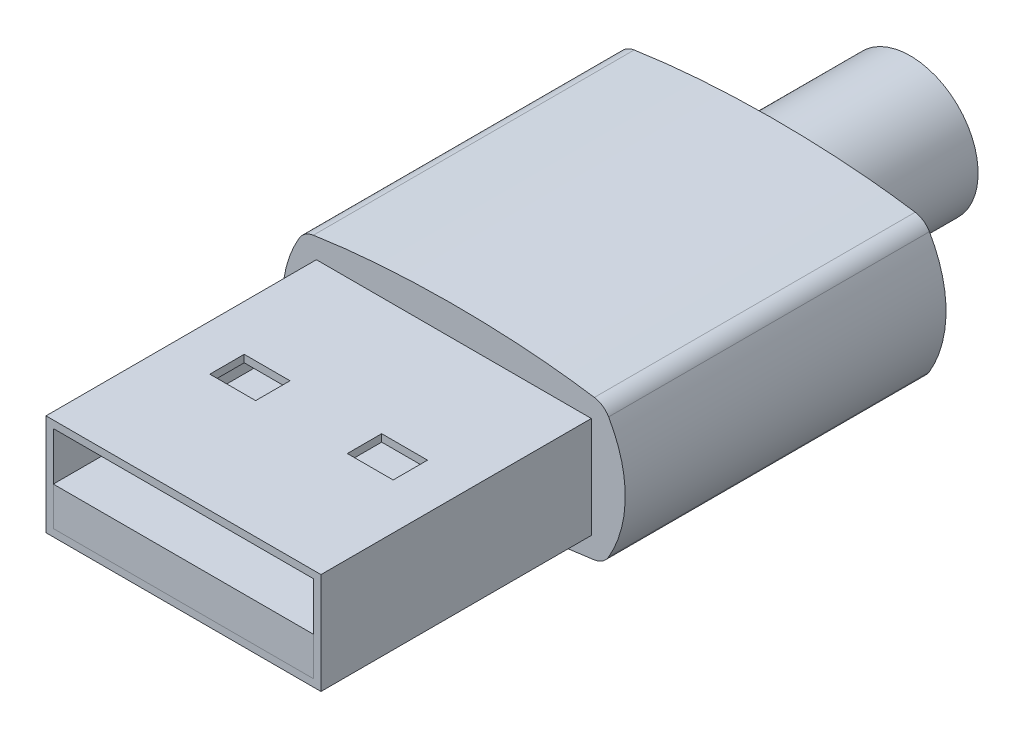
ISO-10303-21;
HEADER;
FILE_DESCRIPTION(('STEP AP214'),'2;1');
FILE_NAME('part.step','',(''),(''),'','','');
FILE_SCHEMA(('AUTOMOTIVE_DESIGN { 1 0 10303 214 1 1 1 1 }'));
ENDSEC;
DATA;
#1=APPLICATION_CONTEXT('core data for automotive mechanical design processes');
#2=APPLICATION_PROTOCOL_DEFINITION('international standard','automotive_design',2000,#1);
#3=PRODUCT_CONTEXT('',#1,'mechanical');
#4=PRODUCT('Part','Part','',(#3));
#5=PRODUCT_RELATED_PRODUCT_CATEGORY('part','',(#4));
#6=PRODUCT_DEFINITION_FORMATION('','',#4);
#7=PRODUCT_DEFINITION_CONTEXT('part definition',#1,'design');
#8=PRODUCT_DEFINITION('design','',#6,#7);
#9=PRODUCT_DEFINITION_SHAPE('','',#8);
#10=(LENGTH_UNIT() NAMED_UNIT(*) SI_UNIT(.MILLI.,.METRE.));
#11=(NAMED_UNIT(*) PLANE_ANGLE_UNIT() SI_UNIT($,.RADIAN.));
#12=(NAMED_UNIT(*) SI_UNIT($,.STERADIAN.) SOLID_ANGLE_UNIT());
#13=UNCERTAINTY_MEASURE_WITH_UNIT(LENGTH_MEASURE(1.E-05),#10,'distance_accuracy_value','');
#14=(GEOMETRIC_REPRESENTATION_CONTEXT(3) GLOBAL_UNCERTAINTY_ASSIGNED_CONTEXT((#13)) GLOBAL_UNIT_ASSIGNED_CONTEXT((#10,
#11,#12)) REPRESENTATION_CONTEXT('',''));
#15=CARTESIAN_POINT('',(0.,0.,0.));
#16=DIRECTION('',(0.,0.,1.));
#17=DIRECTION('',(1.,0.,0.));
#18=AXIS2_PLACEMENT_3D('',#15,#16,#17);
#19=CARTESIAN_POINT('',(0.,0.,0.));
#20=DIRECTION('',(0.,0.,1.));
#21=DIRECTION('',(1.,0.,0.));
#22=AXIS2_PLACEMENT_3D('',#19,#20,#21);
#23=PLANE('',#22);
#24=DIRECTION('',(0.,-1.,0.));
#25=VECTOR('',#24,1.);
#26=CARTESIAN_POINT('',(6.,0.,0.));
#27=LINE('',#26,#25);
#28=CARTESIAN_POINT('',(6.,2.21,0.));
#29=VERTEX_POINT('',#28);
#30=CARTESIAN_POINT('',(6.,-2.21,0.));
#31=VERTEX_POINT('',#30);
#32=EDGE_CURVE('E371',#29,#31,#27,.T.);
#33=ORIENTED_EDGE('',*,*,#32,.F.);
#34=DIRECTION('',(1.,0.,0.));
#35=VECTOR('',#34,1.);
#36=CARTESIAN_POINT('',(0.,2.21,0.));
#37=LINE('',#36,#35);
#38=CARTESIAN_POINT('',(-6.,2.21,0.));
#39=VERTEX_POINT('',#38);
#40=EDGE_CURVE('E421',#39,#29,#37,.T.);
#41=ORIENTED_EDGE('',*,*,#40,.F.);
#42=DIRECTION('',(0.,-1.,0.));
#43=VECTOR('',#42,1.);
#44=CARTESIAN_POINT('',(-6.,0.,0.));
#45=LINE('',#44,#43);
#46=CARTESIAN_POINT('',(-6.,-2.21,0.));
#47=VERTEX_POINT('',#46);
#48=EDGE_CURVE('E417',#39,#47,#45,.T.);
#49=ORIENTED_EDGE('',*,*,#48,.T.);
#50=DIRECTION('',(1.,0.,0.));
#51=VECTOR('',#50,1.);
#52=CARTESIAN_POINT('',(0.,-2.21,0.));
#53=LINE('',#52,#51);
#54=EDGE_CURVE('E413',#47,#31,#53,.T.);
#55=ORIENTED_EDGE('',*,*,#54,.T.);
#56=EDGE_LOOP('',(#33,#41,#49,#55));
#57=FACE_BOUND('',#56,.T.);
#58=DIRECTION('',(-1.,0.,0.));
#59=VECTOR('',#58,1.);
#60=CARTESIAN_POINT('',(0.,-1.89,0.));
#61=LINE('',#60,#59);
#62=CARTESIAN_POINT('',(5.68,-1.89,0.));
#63=VERTEX_POINT('',#62);
#64=CARTESIAN_POINT('',(-5.68,-1.89,0.));
#65=VERTEX_POINT('',#64);
#66=EDGE_CURVE('E374',#63,#65,#61,.T.);
#67=ORIENTED_EDGE('',*,*,#66,.T.);
#68=DIRECTION('',(0.,1.,0.));
#69=VECTOR('',#68,1.);
#70=CARTESIAN_POINT('',(-5.68,0.,0.));
#71=LINE('',#70,#69);
#72=CARTESIAN_POINT('',(-5.68,-0.21,0.));
#73=VERTEX_POINT('',#72);
#74=EDGE_CURVE('E49',#65,#73,#71,.T.);
#75=ORIENTED_EDGE('',*,*,#74,.T.);
#76=DIRECTION('',(0.,-1.,0.));
#77=VECTOR('',#76,1.);
#78=CARTESIAN_POINT('',(-5.68,0.,0.));
#79=LINE('',#78,#77);
#80=CARTESIAN_POINT('',(-5.68,1.89,0.));
#81=VERTEX_POINT('',#80);
#82=EDGE_CURVE('E437',#81,#73,#79,.T.);
#83=ORIENTED_EDGE('',*,*,#82,.F.);
#84=DIRECTION('',(1.,0.,0.));
#85=VECTOR('',#84,1.);
#86=CARTESIAN_POINT('',(0.,1.89,0.));
#87=LINE('',#86,#85);
#88=CARTESIAN_POINT('',(5.68,1.89,0.));
#89=VERTEX_POINT('',#88);
#90=EDGE_CURVE('E433',#81,#89,#87,.T.);
#91=ORIENTED_EDGE('',*,*,#90,.T.);
#92=DIRECTION('',(0.,-1.,0.));
#93=VECTOR('',#92,1.);
#94=CARTESIAN_POINT('',(5.68,0.,0.));
#95=LINE('',#94,#93);
#96=CARTESIAN_POINT('',(5.68,-0.21,0.));
#97=VERTEX_POINT('',#96);
#98=EDGE_CURVE('E430',#89,#97,#95,.T.);
#99=ORIENTED_EDGE('',*,*,#98,.T.);
#100=DIRECTION('',(0.,-1.,0.));
#101=VECTOR('',#100,1.);
#102=CARTESIAN_POINT('',(5.68,0.,0.));
#103=LINE('',#102,#101);
#104=EDGE_CURVE('E378',#97,#63,#103,.T.);
#105=ORIENTED_EDGE('',*,*,#104,.T.);
#106=EDGE_LOOP('',(#67,#75,#83,#91,#99,#105));
#107=FACE_BOUND('',#106,.T.);
#108=ADVANCED_FACE('F45',(#57,#107),#23,.T.);
#109=CARTESIAN_POINT('',(6.,0.,-11.8));
#110=DIRECTION('',(-1.,0.,0.));
#111=DIRECTION('',(0.,-1.,0.));
#112=AXIS2_PLACEMENT_3D('',#109,#110,#111);
#113=PLANE('',#112);
#114=ORIENTED_EDGE('',*,*,#32,.T.);
#115=DIRECTION('',(0.,0.,1.));
#116=VECTOR('',#115,1.);
#117=CARTESIAN_POINT('',(6.,-2.21,-11.8));
#118=LINE('',#117,#116);
#119=CARTESIAN_POINT('',(6.,-2.21,-11.8));
#120=VERTEX_POINT('',#119);
#121=EDGE_CURVE('E383',#120,#31,#118,.T.);
#122=ORIENTED_EDGE('',*,*,#121,.F.);
#123=DIRECTION('',(0.,-1.,0.));
#124=VECTOR('',#123,1.);
#125=CARTESIAN_POINT('',(6.,0.,-11.8));
#126=LINE('',#125,#124);
#127=CARTESIAN_POINT('',(6.,2.21,-11.8));
#128=VERTEX_POINT('',#127);
#129=EDGE_CURVE('E453',#128,#120,#126,.T.);
#130=ORIENTED_EDGE('',*,*,#129,.F.);
#131=DIRECTION('',(0.,0.,1.));
#132=VECTOR('',#131,1.);
#133=CARTESIAN_POINT('',(6.,2.21,-11.8));
#134=LINE('',#133,#132);
#135=EDGE_CURVE('E401',#128,#29,#134,.T.);
#136=ORIENTED_EDGE('',*,*,#135,.T.);
#137=EDGE_LOOP('',(#114,#122,#130,#136));
#138=FACE_BOUND('',#137,.T.);
#139=ADVANCED_FACE('F339',(#138),#113,.F.);
#140=CARTESIAN_POINT('',(0.,-2.21,-11.8));
#141=DIRECTION('',(0.,-1.,0.));
#142=DIRECTION('',(0.,0.,-1.));
#143=AXIS2_PLACEMENT_3D('',#140,#141,#142);
#144=PLANE('',#143);
#145=ORIENTED_EDGE('',*,*,#54,.F.);
#146=DIRECTION('',(0.,0.,1.));
#147=VECTOR('',#146,1.);
#148=CARTESIAN_POINT('',(-6.,-2.21,-11.8));
#149=LINE('',#148,#147);
#150=CARTESIAN_POINT('',(-6.,-2.21,-11.8));
#151=VERTEX_POINT('',#150);
#152=EDGE_CURVE('E408',#151,#47,#149,.T.);
#153=ORIENTED_EDGE('',*,*,#152,.F.);
#154=DIRECTION('',(1.,0.,0.));
#155=VECTOR('',#154,1.);
#156=CARTESIAN_POINT('',(0.,-2.21,-11.8));
#157=LINE('',#156,#155);
#158=EDGE_CURVE('E390',#151,#120,#157,.T.);
#159=ORIENTED_EDGE('',*,*,#158,.T.);
#160=ORIENTED_EDGE('',*,*,#121,.T.);
#161=EDGE_LOOP('',(#145,#153,#159,#160));
#162=FACE_BOUND('',#161,.T.);
#163=ADVANCED_FACE('F335',(#162),#144,.T.);
#164=CARTESIAN_POINT('',(-6.,0.,-11.8));
#165=DIRECTION('',(-1.,0.,0.));
#166=DIRECTION('',(0.,-1.,0.));
#167=AXIS2_PLACEMENT_3D('',#164,#165,#166);
#168=PLANE('',#167);
#169=ORIENTED_EDGE('',*,*,#48,.F.);
#170=DIRECTION('',(0.,0.,1.));
#171=VECTOR('',#170,1.);
#172=CARTESIAN_POINT('',(-6.,2.21,-11.8));
#173=LINE('',#172,#171);
#174=CARTESIAN_POINT('',(-6.,2.21,-11.8));
#175=VERTEX_POINT('',#174);
#176=EDGE_CURVE('E405',#175,#39,#173,.T.);
#177=ORIENTED_EDGE('',*,*,#176,.F.);
#178=DIRECTION('',(0.,-1.,0.));
#179=VECTOR('',#178,1.);
#180=CARTESIAN_POINT('',(-6.,0.,-11.8));
#181=LINE('',#180,#179);
#182=EDGE_CURVE('E445',#175,#151,#181,.T.);
#183=ORIENTED_EDGE('',*,*,#182,.T.);
#184=ORIENTED_EDGE('',*,*,#152,.T.);
#185=EDGE_LOOP('',(#169,#177,#183,#184));
#186=FACE_BOUND('',#185,.T.);
#187=ADVANCED_FACE('F338',(#186),#168,.T.);
#188=CARTESIAN_POINT('',(-5.68,0.,-11.8));
#189=DIRECTION('',(-1.,0.,0.));
#190=DIRECTION('',(0.,-1.,0.));
#191=AXIS2_PLACEMENT_3D('',#188,#189,#190);
#192=PLANE('',#191);
#193=ORIENTED_EDGE('',*,*,#82,.T.);
#194=DIRECTION('',(0.,0.,1.));
#195=VECTOR('',#194,1.);
#196=CARTESIAN_POINT('',(-5.68,-0.21,-11.8));
#197=LINE('',#196,#195);
#198=CARTESIAN_POINT('',(-5.68,-0.21,-11.8));
#199=VERTEX_POINT('',#198);
#200=EDGE_CURVE('E397',#199,#73,#197,.T.);
#201=ORIENTED_EDGE('',*,*,#200,.F.);
#202=DIRECTION('',(0.,-1.,0.));
#203=VECTOR('',#202,1.);
#204=CARTESIAN_POINT('',(-5.68,0.,-11.8));
#205=LINE('',#204,#203);
#206=CARTESIAN_POINT('',(-5.68,1.89,-11.8));
#207=VERTEX_POINT('',#206);
#208=EDGE_CURVE('E416',#207,#199,#205,.T.);
#209=ORIENTED_EDGE('',*,*,#208,.F.);
#210=DIRECTION('',(0.,0.,1.));
#211=VECTOR('',#210,1.);
#212=CARTESIAN_POINT('',(-5.68,1.89,-11.8));
#213=LINE('',#212,#211);
#214=EDGE_CURVE('E386',#207,#81,#213,.T.);
#215=ORIENTED_EDGE('',*,*,#214,.T.);
#216=EDGE_LOOP('',(#193,#201,#209,#215));
#217=FACE_BOUND('',#216,.T.);
#218=ADVANCED_FACE('F47',(#217),#192,.F.);
#219=CARTESIAN_POINT('',(0.,-0.21,-11.8));
#220=DIRECTION('',(0.,-1.,0.));
#221=DIRECTION('',(0.,0.,-1.));
#222=AXIS2_PLACEMENT_3D('',#219,#220,#221);
#223=PLANE('',#222);
#224=DIRECTION('',(1.,0.,0.));
#225=VECTOR('',#224,1.);
#226=CARTESIAN_POINT('',(0.,-0.21,0.));
#227=LINE('',#226,#225);
#228=EDGE_CURVE('E426',#73,#97,#227,.T.);
#229=ORIENTED_EDGE('',*,*,#228,.T.);
#230=DIRECTION('',(0.,0.,1.));
#231=VECTOR('',#230,1.);
#232=CARTESIAN_POINT('',(5.68,-0.21,-11.8));
#233=LINE('',#232,#231);
#234=CARTESIAN_POINT('',(5.68,-0.21,-11.8));
#235=VERTEX_POINT('',#234);
#236=EDGE_CURVE('E393',#235,#97,#233,.T.);
#237=ORIENTED_EDGE('',*,*,#236,.F.);
#238=DIRECTION('',(1.,0.,0.));
#239=VECTOR('',#238,1.);
#240=CARTESIAN_POINT('',(0.,-0.21,-11.8));
#241=LINE('',#240,#239);
#242=EDGE_CURVE('E457',#199,#235,#241,.T.);
#243=ORIENTED_EDGE('',*,*,#242,.F.);
#244=ORIENTED_EDGE('',*,*,#200,.T.);
#245=EDGE_LOOP('',(#229,#237,#243,#244));
#246=FACE_BOUND('',#245,.T.);
#247=ADVANCED_FACE('F350',(#246),#223,.F.);
#248=CARTESIAN_POINT('',(5.68,0.,-11.8));
#249=DIRECTION('',(-1.,0.,0.));
#250=DIRECTION('',(0.,0.,1.));
#251=AXIS2_PLACEMENT_3D('',#248,#249,#250);
#252=PLANE('',#251);
#253=ORIENTED_EDGE('',*,*,#98,.F.);
#254=DIRECTION('',(0.,0.,1.));
#255=VECTOR('',#254,1.);
#256=CARTESIAN_POINT('',(5.68,1.89,-11.8));
#257=LINE('',#256,#255);
#258=CARTESIAN_POINT('',(5.68,1.89,-11.8));
#259=VERTEX_POINT('',#258);
#260=EDGE_CURVE('E389',#259,#89,#257,.T.);
#261=ORIENTED_EDGE('',*,*,#260,.F.);
#262=DIRECTION('',(0.,-1.,0.));
#263=VECTOR('',#262,1.);
#264=CARTESIAN_POINT('',(5.68,0.,-11.8));
#265=LINE('',#264,#263);
#266=EDGE_CURVE('E460',#259,#235,#265,.T.);
#267=ORIENTED_EDGE('',*,*,#266,.T.);
#268=ORIENTED_EDGE('',*,*,#236,.T.);
#269=EDGE_LOOP('',(#253,#261,#267,#268));
#270=FACE_BOUND('',#269,.T.);
#271=ADVANCED_FACE('F353',(#270),#252,.T.);
#272=CARTESIAN_POINT('',(0.,1.89,-11.8));
#273=DIRECTION('',(0.,-1.,0.));
#274=DIRECTION('',(0.,0.,-1.));
#275=AXIS2_PLACEMENT_3D('',#272,#273,#274);
#276=PLANE('',#275);
#277=DIRECTION('',(0.,0.,-1.));
#278=VECTOR('',#277,1.);
#279=CARTESIAN_POINT('',(4.,1.89,-5.15));
#280=LINE('',#279,#278);
#281=CARTESIAN_POINT('',(4.,1.89,-5.15));
#282=VERTEX_POINT('',#281);
#283=CARTESIAN_POINT('',(4.,1.89,-6.65));
#284=VERTEX_POINT('',#283);
#285=EDGE_CURVE('E228',#282,#284,#280,.T.);
#286=ORIENTED_EDGE('',*,*,#285,.T.);
#287=DIRECTION('',(-1.,0.,0.));
#288=VECTOR('',#287,1.);
#289=CARTESIAN_POINT('',(4.,1.89,-6.65));
#290=LINE('',#289,#288);
#291=CARTESIAN_POINT('',(2.,1.89,-6.65));
#292=VERTEX_POINT('',#291);
#293=EDGE_CURVE('E214',#284,#292,#290,.T.);
#294=ORIENTED_EDGE('',*,*,#293,.T.);
#295=DIRECTION('',(0.,0.,1.));
#296=VECTOR('',#295,1.);
#297=CARTESIAN_POINT('',(2.,1.89,-5.15));
#298=LINE('',#297,#296);
#299=CARTESIAN_POINT('',(2.,1.89,-5.15));
#300=VERTEX_POINT('',#299);
#301=EDGE_CURVE('E255',#292,#300,#298,.T.);
#302=ORIENTED_EDGE('',*,*,#301,.T.);
#303=DIRECTION('',(1.,0.,0.));
#304=VECTOR('',#303,1.);
#305=CARTESIAN_POINT('',(4.,1.89,-5.15));
#306=LINE('',#305,#304);
#307=EDGE_CURVE('E237',#300,#282,#306,.T.);
#308=ORIENTED_EDGE('',*,*,#307,.T.);
#309=EDGE_LOOP('',(#286,#294,#302,#308));
#310=FACE_BOUND('',#309,.T.);
#311=DIRECTION('',(-1.,0.,0.));
#312=VECTOR('',#311,1.);
#313=CARTESIAN_POINT('',(-4.,1.89,-6.65));
#314=LINE('',#313,#312);
#315=CARTESIAN_POINT('',(-2.,1.89,-6.65));
#316=VERTEX_POINT('',#315);
#317=CARTESIAN_POINT('',(-4.,1.89,-6.65));
#318=VERTEX_POINT('',#317);
#319=EDGE_CURVE('E266',#316,#318,#314,.T.);
#320=ORIENTED_EDGE('',*,*,#319,.T.);
#321=DIRECTION('',(0.,0.,1.));
#322=VECTOR('',#321,1.);
#323=CARTESIAN_POINT('',(-4.,1.89,-5.15));
#324=LINE('',#323,#322);
#325=CARTESIAN_POINT('',(-4.,1.89,-5.15));
#326=VERTEX_POINT('',#325);
#327=EDGE_CURVE('E295',#318,#326,#324,.T.);
#328=ORIENTED_EDGE('',*,*,#327,.T.);
#329=DIRECTION('',(1.,0.,0.));
#330=VECTOR('',#329,1.);
#331=CARTESIAN_POINT('',(-4.,1.89,-5.15));
#332=LINE('',#331,#330);
#333=CARTESIAN_POINT('',(-2.,1.89,-5.15));
#334=VERTEX_POINT('',#333);
#335=EDGE_CURVE('E290',#326,#334,#332,.T.);
#336=ORIENTED_EDGE('',*,*,#335,.T.);
#337=DIRECTION('',(0.,0.,-1.));
#338=VECTOR('',#337,1.);
#339=CARTESIAN_POINT('',(-2.,1.89,-5.15));
#340=LINE('',#339,#338);
#341=EDGE_CURVE('E285',#334,#316,#340,.T.);
#342=ORIENTED_EDGE('',*,*,#341,.T.);
#343=EDGE_LOOP('',(#320,#328,#336,#342));
#344=FACE_BOUND('',#343,.T.);
#345=ORIENTED_EDGE('',*,*,#90,.F.);
#346=ORIENTED_EDGE('',*,*,#214,.F.);
#347=DIRECTION('',(1.,0.,0.));
#348=VECTOR('',#347,1.);
#349=CARTESIAN_POINT('',(0.,1.89,-11.8));
#350=LINE('',#349,#348);
#351=EDGE_CURVE('E464',#207,#259,#350,.T.);
#352=ORIENTED_EDGE('',*,*,#351,.T.);
#353=ORIENTED_EDGE('',*,*,#260,.T.);
#354=EDGE_LOOP('',(#345,#346,#352,#353));
#355=FACE_BOUND('',#354,.T.);
#356=ADVANCED_FACE('F235',(#310,#344,#355),#276,.T.);
#357=CARTESIAN_POINT('',(0.,2.21,-11.8));
#358=DIRECTION('',(0.,-1.,0.));
#359=DIRECTION('',(0.,0.,-1.));
#360=AXIS2_PLACEMENT_3D('',#357,#358,#359);
#361=PLANE('',#360);
#362=DIRECTION('',(-1.,0.,0.));
#363=VECTOR('',#362,1.);
#364=CARTESIAN_POINT('',(4.,2.21,-6.65));
#365=LINE('',#364,#363);
#366=CARTESIAN_POINT('',(4.,2.21,-6.65));
#367=VERTEX_POINT('',#366);
#368=CARTESIAN_POINT('',(2.,2.21,-6.65));
#369=VERTEX_POINT('',#368);
#370=EDGE_CURVE('E242',#367,#369,#365,.T.);
#371=ORIENTED_EDGE('',*,*,#370,.F.);
#372=DIRECTION('',(0.,0.,-1.));
#373=VECTOR('',#372,1.);
#374=CARTESIAN_POINT('',(4.,2.21,-5.15));
#375=LINE('',#374,#373);
#376=CARTESIAN_POINT('',(4.,2.21,-5.15));
#377=VERTEX_POINT('',#376);
#378=EDGE_CURVE('E231',#377,#367,#375,.T.);
#379=ORIENTED_EDGE('',*,*,#378,.F.);
#380=DIRECTION('',(1.,0.,0.));
#381=VECTOR('',#380,1.);
#382=CARTESIAN_POINT('',(4.,2.21,-5.15));
#383=LINE('',#382,#381);
#384=CARTESIAN_POINT('',(2.,2.21,-5.15));
#385=VERTEX_POINT('',#384);
#386=EDGE_CURVE('E249',#385,#377,#383,.T.);
#387=ORIENTED_EDGE('',*,*,#386,.F.);
#388=DIRECTION('',(0.,0.,1.));
#389=VECTOR('',#388,1.);
#390=CARTESIAN_POINT('',(2.,2.21,-5.15));
#391=LINE('',#390,#389);
#392=EDGE_CURVE('E239',#369,#385,#391,.T.);
#393=ORIENTED_EDGE('',*,*,#392,.F.);
#394=EDGE_LOOP('',(#371,#379,#387,#393));
#395=FACE_BOUND('',#394,.T.);
#396=DIRECTION('',(0.,0.,1.));
#397=VECTOR('',#396,1.);
#398=CARTESIAN_POINT('',(-4.,2.21,-5.15));
#399=LINE('',#398,#397);
#400=CARTESIAN_POINT('',(-4.,2.21,-6.65));
#401=VERTEX_POINT('',#400);
#402=CARTESIAN_POINT('',(-4.,2.21,-5.15));
#403=VERTEX_POINT('',#402);
#404=EDGE_CURVE('E274',#401,#403,#399,.T.);
#405=ORIENTED_EDGE('',*,*,#404,.F.);
#406=DIRECTION('',(-1.,0.,0.));
#407=VECTOR('',#406,1.);
#408=CARTESIAN_POINT('',(-4.,2.21,-6.65));
#409=LINE('',#408,#407);
#410=CARTESIAN_POINT('',(-2.,2.21,-6.65));
#411=VERTEX_POINT('',#410);
#412=EDGE_CURVE('E278',#411,#401,#409,.T.);
#413=ORIENTED_EDGE('',*,*,#412,.F.);
#414=DIRECTION('',(0.,0.,-1.));
#415=VECTOR('',#414,1.);
#416=CARTESIAN_POINT('',(-2.,2.21,-5.15));
#417=LINE('',#416,#415);
#418=CARTESIAN_POINT('',(-2.,2.21,-5.15));
#419=VERTEX_POINT('',#418);
#420=EDGE_CURVE('E282',#419,#411,#417,.T.);
#421=ORIENTED_EDGE('',*,*,#420,.F.);
#422=DIRECTION('',(1.,0.,0.));
#423=VECTOR('',#422,1.);
#424=CARTESIAN_POINT('',(-4.,2.21,-5.15));
#425=LINE('',#424,#423);
#426=EDGE_CURVE('E271',#403,#419,#425,.T.);
#427=ORIENTED_EDGE('',*,*,#426,.F.);
#428=EDGE_LOOP('',(#405,#413,#421,#427));
#429=FACE_BOUND('',#428,.T.);
#430=ORIENTED_EDGE('',*,*,#40,.T.);
#431=ORIENTED_EDGE('',*,*,#135,.F.);
#432=DIRECTION('',(1.,0.,0.));
#433=VECTOR('',#432,1.);
#434=CARTESIAN_POINT('',(0.,2.21,-11.8));
#435=LINE('',#434,#433);
#436=EDGE_CURVE('E449',#175,#128,#435,.T.);
#437=ORIENTED_EDGE('',*,*,#436,.F.);
#438=ORIENTED_EDGE('',*,*,#176,.T.);
#439=EDGE_LOOP('',(#430,#431,#437,#438));
#440=FACE_BOUND('',#439,.T.);
#441=ADVANCED_FACE('F333',(#395,#429,#440),#361,.F.);
#442=ORIENTED_EDGE('',*,*,#74,.F.);
#443=ORIENTED_EDGE('',*,*,#66,.F.);
#444=ORIENTED_EDGE('',*,*,#104,.F.);
#445=ORIENTED_EDGE('',*,*,#228,.F.);
#446=EDGE_LOOP('',(#442,#443,#444,#445));
#447=FACE_BOUND('',#446,.T.);
#448=ADVANCED_FACE('F329',(#447),#23,.T.);
#449=CARTESIAN_POINT('',(0.,0.,-25.8));
#450=DIRECTION('',(0.,0.,-1.));
#451=DIRECTION('',(-1.,0.,0.));
#452=AXIS2_PLACEMENT_3D('',#449,#450,#451);
#453=PLANE('',#452);
#454=CARTESIAN_POINT('',(0.,0.,-25.8));
#455=DIRECTION('',(0.,0.,-1.));
#456=DIRECTION('',(-1.,0.,0.));
#457=AXIS2_PLACEMENT_3D('',#454,#455,#456);
#458=CIRCLE('',#457,2.96);
#459=CARTESIAN_POINT('',(-2.96,0.,-25.8));
#460=VERTEX_POINT('',#459);
#461=EDGE_CURVE('E11',#460,#460,#458,.T.);
#462=ORIENTED_EDGE('',*,*,#461,.F.);
#463=EDGE_LOOP('',(#462));
#464=FACE_BOUND('',#463,.T.);
#465=CARTESIAN_POINT('',(0.,0.,-25.8));
#466=DIRECTION('',(0.,0.,-1.));
#467=DIRECTION('',(1.,0.,0.));
#468=AXIS2_PLACEMENT_3D('',#465,#466,#467);
#469=ELLIPSE('',#468,12.665918953446,3.51);
#470=CARTESIAN_POINT('',(6.13205357131284,-3.0712205721688,-25.8));
#471=VERTEX_POINT('',#470);
#472=CARTESIAN_POINT('',(-6.13205357131284,-3.0712205721688,-25.8));
#473=VERTEX_POINT('',#472);
#474=EDGE_CURVE('E312',#471,#473,#469,.T.);
#475=ORIENTED_EDGE('',*,*,#474,.T.);
#476=CARTESIAN_POINT('',(-6.,-2.21,-25.8));
#477=DIRECTION('',(0.,0.,-1.));
#478=DIRECTION('',(-1.,0.,0.));
#479=AXIS2_PLACEMENT_3D('',#476,#477,#478);
#480=CIRCLE('',#479,0.871285842662002);
#481=CARTESIAN_POINT('',(-6.75436074099455,-2.64598038037209,-25.8));
#482=VERTEX_POINT('',#481);
#483=EDGE_CURVE('E317',#473,#482,#480,.T.);
#484=ORIENTED_EDGE('',*,*,#483,.T.);
#485=CARTESIAN_POINT('',(0.,0.,-25.8));
#486=DIRECTION('',(0.,0.,-1.));
#487=DIRECTION('',(1.,0.,0.));
#488=AXIS2_PLACEMENT_3D('',#485,#486,#487);
#489=ELLIPSE('',#488,7.48,6.15827172943257);
#490=CARTESIAN_POINT('',(-6.75436074099455,2.64598038037209,-25.8));
#491=VERTEX_POINT('',#490);
#492=EDGE_CURVE('E556',#482,#491,#489,.T.);
#493=ORIENTED_EDGE('',*,*,#492,.T.);
#494=CARTESIAN_POINT('',(-6.,2.21,-25.8));
#495=DIRECTION('',(0.,0.,-1.));
#496=DIRECTION('',(-1.,0.,0.));
#497=AXIS2_PLACEMENT_3D('',#494,#495,#496);
#498=CIRCLE('',#497,0.871285842662001);
#499=CARTESIAN_POINT('',(-6.13205357131284,3.0712205721688,-25.8));
#500=VERTEX_POINT('',#499);
#501=EDGE_CURVE('E554',#491,#500,#498,.T.);
#502=ORIENTED_EDGE('',*,*,#501,.T.);
#503=CARTESIAN_POINT('',(0.,0.,-25.8));
#504=DIRECTION('',(0.,0.,-1.));
#505=DIRECTION('',(1.,0.,0.));
#506=AXIS2_PLACEMENT_3D('',#503,#504,#505);
#507=ELLIPSE('',#506,12.665918953446,3.51);
#508=CARTESIAN_POINT('',(6.13205357131284,3.0712205721688,-25.8));
#509=VERTEX_POINT('',#508);
#510=EDGE_CURVE('E550',#500,#509,#507,.T.);
#511=ORIENTED_EDGE('',*,*,#510,.T.);
#512=CARTESIAN_POINT('',(6.,2.21,-25.8));
#513=DIRECTION('',(0.,0.,-1.));
#514=DIRECTION('',(-1.,0.,0.));
#515=AXIS2_PLACEMENT_3D('',#512,#513,#514);
#516=CIRCLE('',#515,0.871285842662001);
#517=CARTESIAN_POINT('',(6.75436074099455,2.64598038037209,-25.8));
#518=VERTEX_POINT('',#517);
#519=EDGE_CURVE('E531',#509,#518,#516,.T.);
#520=ORIENTED_EDGE('',*,*,#519,.T.);
#521=CARTESIAN_POINT('',(0.,0.,-25.8));
#522=DIRECTION('',(0.,0.,-1.));
#523=DIRECTION('',(1.,0.,0.));
#524=AXIS2_PLACEMENT_3D('',#521,#522,#523);
#525=ELLIPSE('',#524,7.48,6.15827172943257);
#526=CARTESIAN_POINT('',(6.75436074099455,-2.64598038037209,-25.8));
#527=VERTEX_POINT('',#526);
#528=EDGE_CURVE('E527',#518,#527,#525,.T.);
#529=ORIENTED_EDGE('',*,*,#528,.T.);
#530=CARTESIAN_POINT('',(6.,-2.21,-25.8));
#531=DIRECTION('',(0.,0.,-1.));
#532=DIRECTION('',(-1.,0.,0.));
#533=AXIS2_PLACEMENT_3D('',#530,#531,#532);
#534=CIRCLE('',#533,0.871285842662001);
#535=EDGE_CURVE('E501',#527,#471,#534,.T.);
#536=ORIENTED_EDGE('',*,*,#535,.T.);
#537=EDGE_LOOP('',(#475,#484,#493,#502,#511,#520,#529,#536));
#538=FACE_BOUND('',#537,.T.);
#539=ADVANCED_FACE('F332',(#464,#538),#453,.T.);
#540=CARTESIAN_POINT('',(6.,-2.21,-25.8));
#541=DIRECTION('',(0.,0.,1.));
#542=DIRECTION('',(1.,0.,0.));
#543=AXIS2_PLACEMENT_3D('',#540,#541,#542);
#544=CYLINDRICAL_SURFACE('',#543,0.871285842662001);
#545=CARTESIAN_POINT('',(6.,-2.21,-11.8));
#546=DIRECTION('',(0.,0.,-1.));
#547=DIRECTION('',(-1.,0.,0.));
#548=AXIS2_PLACEMENT_3D('',#545,#546,#547);
#549=CIRCLE('',#548,0.871285842662001);
#550=CARTESIAN_POINT('',(6.75436074099455,-2.64598038037209,-11.8));
#551=VERTEX_POINT('',#550);
#552=CARTESIAN_POINT('',(6.13205357131284,-3.0712205721688,-11.8));
#553=VERTEX_POINT('',#552);
#554=EDGE_CURVE('E318',#551,#553,#549,.T.);
#555=ORIENTED_EDGE('',*,*,#554,.T.);
#556=DIRECTION('',(0.,0.,1.));
#557=VECTOR('',#556,1.);
#558=CARTESIAN_POINT('',(6.13205357131284,-3.0712205721688,-25.8));
#559=LINE('',#558,#557);
#560=EDGE_CURVE('E497',#471,#553,#559,.T.);
#561=ORIENTED_EDGE('',*,*,#560,.F.);
#562=ORIENTED_EDGE('',*,*,#535,.F.);
#563=DIRECTION('',(0.,0.,1.));
#564=VECTOR('',#563,1.);
#565=CARTESIAN_POINT('',(6.75436074099455,-2.64598038037209,-25.8));
#566=LINE('',#565,#564);
#567=EDGE_CURVE('E493',#527,#551,#566,.T.);
#568=ORIENTED_EDGE('',*,*,#567,.T.);
#569=EDGE_LOOP('',(#555,#561,#562,#568));
#570=FACE_BOUND('',#569,.T.);
#571=ADVANCED_FACE('F539',(#570),#544,.T.);
#572=DIRECTION('',(0.,0.,1.));
#573=VECTOR('',#572,1.);
#574=SURFACE_OF_LINEAR_EXTRUSION('',#525,#573);
#575=CARTESIAN_POINT('',(0.,0.,-11.8));
#576=DIRECTION('',(0.,0.,-1.));
#577=DIRECTION('',(1.,0.,0.));
#578=AXIS2_PLACEMENT_3D('',#575,#576,#577);
#579=ELLIPSE('',#578,7.48,6.15827172943257);
#580=CARTESIAN_POINT('',(6.75436074099455,2.64598038037209,-11.8));
#581=VERTEX_POINT('',#580);
#582=EDGE_CURVE('E504',#581,#551,#579,.T.);
#583=ORIENTED_EDGE('',*,*,#582,.T.);
#584=ORIENTED_EDGE('',*,*,#567,.F.);
#585=ORIENTED_EDGE('',*,*,#528,.F.);
#586=DIRECTION('',(0.,0.,1.));
#587=VECTOR('',#586,1.);
#588=CARTESIAN_POINT('',(6.75436074099455,2.64598038037209,-25.8));
#589=LINE('',#588,#587);
#590=EDGE_CURVE('E489',#518,#581,#589,.T.);
#591=ORIENTED_EDGE('',*,*,#590,.T.);
#592=EDGE_LOOP('',(#583,#584,#585,#591));
#593=FACE_BOUND('',#592,.T.);
#594=ADVANCED_FACE('F534',(#593),#574,.F.);
#595=CARTESIAN_POINT('',(6.,2.21,-25.8));
#596=DIRECTION('',(0.,0.,1.));
#597=DIRECTION('',(1.,0.,0.));
#598=AXIS2_PLACEMENT_3D('',#595,#596,#597);
#599=CYLINDRICAL_SURFACE('',#598,0.871285842662001);
#600=CARTESIAN_POINT('',(6.,2.21,-11.8));
#601=DIRECTION('',(0.,0.,-1.));
#602=DIRECTION('',(-1.,0.,0.));
#603=AXIS2_PLACEMENT_3D('',#600,#601,#602);
#604=CIRCLE('',#603,0.871285842662001);
#605=CARTESIAN_POINT('',(6.13205357131284,3.0712205721688,-11.8));
#606=VERTEX_POINT('',#605);
#607=EDGE_CURVE('E507',#606,#581,#604,.T.);
#608=ORIENTED_EDGE('',*,*,#607,.T.);
#609=ORIENTED_EDGE('',*,*,#590,.F.);
#610=ORIENTED_EDGE('',*,*,#519,.F.);
#611=DIRECTION('',(0.,0.,1.));
#612=VECTOR('',#611,1.);
#613=CARTESIAN_POINT('',(6.13205357131284,3.0712205721688,-25.8));
#614=LINE('',#613,#612);
#615=EDGE_CURVE('E485',#509,#606,#614,.T.);
#616=ORIENTED_EDGE('',*,*,#615,.T.);
#617=EDGE_LOOP('',(#608,#609,#610,#616));
#618=FACE_BOUND('',#617,.T.);
#619=ADVANCED_FACE('F538',(#618),#599,.T.);
#620=DIRECTION('',(0.,0.,1.));
#621=VECTOR('',#620,1.);
#622=SURFACE_OF_LINEAR_EXTRUSION('',#507,#621);
#623=CARTESIAN_POINT('',(0.,0.,-11.8));
#624=DIRECTION('',(0.,0.,-1.));
#625=DIRECTION('',(1.,0.,0.));
#626=AXIS2_PLACEMENT_3D('',#623,#624,#625);
#627=ELLIPSE('',#626,12.665918953446,3.51);
#628=CARTESIAN_POINT('',(-6.13205357131284,3.0712205721688,-11.8));
#629=VERTEX_POINT('',#628);
#630=EDGE_CURVE('E510',#629,#606,#627,.T.);
#631=ORIENTED_EDGE('',*,*,#630,.T.);
#632=ORIENTED_EDGE('',*,*,#615,.F.);
#633=ORIENTED_EDGE('',*,*,#510,.F.);
#634=DIRECTION('',(0.,0.,1.));
#635=VECTOR('',#634,1.);
#636=CARTESIAN_POINT('',(-6.13205357131284,3.0712205721688,-25.8));
#637=LINE('',#636,#635);
#638=EDGE_CURVE('E481',#500,#629,#637,.T.);
#639=ORIENTED_EDGE('',*,*,#638,.T.);
#640=EDGE_LOOP('',(#631,#632,#633,#639));
#641=FACE_BOUND('',#640,.T.);
#642=ADVANCED_FACE('F544',(#641),#622,.F.);
#643=CARTESIAN_POINT('',(-6.,2.21,-25.8));
#644=DIRECTION('',(0.,0.,1.));
#645=DIRECTION('',(1.,0.,0.));
#646=AXIS2_PLACEMENT_3D('',#643,#644,#645);
#647=CYLINDRICAL_SURFACE('',#646,0.871285842662001);
#648=CARTESIAN_POINT('',(-6.,2.21,-11.8));
#649=DIRECTION('',(0.,0.,-1.));
#650=DIRECTION('',(-1.,0.,0.));
#651=AXIS2_PLACEMENT_3D('',#648,#649,#650);
#652=CIRCLE('',#651,0.871285842662001);
#653=CARTESIAN_POINT('',(-6.75436074099455,2.64598038037209,-11.8));
#654=VERTEX_POINT('',#653);
#655=EDGE_CURVE('E513',#654,#629,#652,.T.);
#656=ORIENTED_EDGE('',*,*,#655,.T.);
#657=ORIENTED_EDGE('',*,*,#638,.F.);
#658=ORIENTED_EDGE('',*,*,#501,.F.);
#659=DIRECTION('',(0.,0.,1.));
#660=VECTOR('',#659,1.);
#661=CARTESIAN_POINT('',(-6.75436074099455,2.64598038037209,-25.8));
#662=LINE('',#661,#660);
#663=EDGE_CURVE('E477',#491,#654,#662,.T.);
#664=ORIENTED_EDGE('',*,*,#663,.T.);
#665=EDGE_LOOP('',(#656,#657,#658,#664));
#666=FACE_BOUND('',#665,.T.);
#667=ADVANCED_FACE('F548',(#666),#647,.T.);
#668=DIRECTION('',(0.,0.,1.));
#669=VECTOR('',#668,1.);
#670=SURFACE_OF_LINEAR_EXTRUSION('',#489,#669);
#671=CARTESIAN_POINT('',(0.,0.,-11.8));
#672=DIRECTION('',(0.,0.,-1.));
#673=DIRECTION('',(1.,0.,0.));
#674=AXIS2_PLACEMENT_3D('',#671,#672,#673);
#675=ELLIPSE('',#674,7.48,6.15827172943257);
#676=CARTESIAN_POINT('',(-6.75436074099455,-2.64598038037209,-11.8));
#677=VERTEX_POINT('',#676);
#678=EDGE_CURVE('E516',#677,#654,#675,.T.);
#679=ORIENTED_EDGE('',*,*,#678,.T.);
#680=ORIENTED_EDGE('',*,*,#663,.F.);
#681=ORIENTED_EDGE('',*,*,#492,.F.);
#682=DIRECTION('',(0.,0.,1.));
#683=VECTOR('',#682,1.);
#684=CARTESIAN_POINT('',(-6.75436074099455,-2.64598038037209,-25.8));
#685=LINE('',#684,#683);
#686=EDGE_CURVE('E473',#482,#677,#685,.T.);
#687=ORIENTED_EDGE('',*,*,#686,.T.);
#688=EDGE_LOOP('',(#679,#680,#681,#687));
#689=FACE_BOUND('',#688,.T.);
#690=ADVANCED_FACE('F559',(#689),#670,.F.);
#691=CARTESIAN_POINT('',(-6.,-2.21,-25.8));
#692=DIRECTION('',(0.,0.,1.));
#693=DIRECTION('',(1.,0.,0.));
#694=AXIS2_PLACEMENT_3D('',#691,#692,#693);
#695=CYLINDRICAL_SURFACE('',#694,0.871285842662002);
#696=CARTESIAN_POINT('',(-6.,-2.21,-11.8));
#697=DIRECTION('',(0.,0.,-1.));
#698=DIRECTION('',(-1.,0.,0.));
#699=AXIS2_PLACEMENT_3D('',#696,#697,#698);
#700=CIRCLE('',#699,0.871285842662002);
#701=CARTESIAN_POINT('',(-6.13205357131284,-3.0712205721688,-11.8));
#702=VERTEX_POINT('',#701);
#703=EDGE_CURVE('E519',#702,#677,#700,.T.);
#704=ORIENTED_EDGE('',*,*,#703,.T.);
#705=ORIENTED_EDGE('',*,*,#686,.F.);
#706=ORIENTED_EDGE('',*,*,#483,.F.);
#707=DIRECTION('',(0.,0.,1.));
#708=VECTOR('',#707,1.);
#709=CARTESIAN_POINT('',(-6.13205357131284,-3.0712205721688,-25.8));
#710=LINE('',#709,#708);
#711=EDGE_CURVE('E441',#473,#702,#710,.T.);
#712=ORIENTED_EDGE('',*,*,#711,.T.);
#713=EDGE_LOOP('',(#704,#705,#706,#712));
#714=FACE_BOUND('',#713,.T.);
#715=ADVANCED_FACE('F326',(#714),#695,.T.);
#716=DIRECTION('',(0.,0.,1.));
#717=VECTOR('',#716,1.);
#718=SURFACE_OF_LINEAR_EXTRUSION('',#469,#717);
#719=CARTESIAN_POINT('',(0.,0.,-11.8));
#720=DIRECTION('',(0.,0.,-1.));
#721=DIRECTION('',(1.,0.,0.));
#722=AXIS2_PLACEMENT_3D('',#719,#720,#721);
#723=ELLIPSE('',#722,12.665918953446,3.51);
#724=EDGE_CURVE('E310',#553,#702,#723,.T.);
#725=ORIENTED_EDGE('',*,*,#724,.T.);
#726=ORIENTED_EDGE('',*,*,#711,.F.);
#727=ORIENTED_EDGE('',*,*,#474,.F.);
#728=ORIENTED_EDGE('',*,*,#560,.T.);
#729=EDGE_LOOP('',(#725,#726,#727,#728));
#730=FACE_BOUND('',#729,.T.);
#731=ADVANCED_FACE('F321',(#730),#718,.F.);
#732=CARTESIAN_POINT('',(0.,0.,-11.8));
#733=DIRECTION('',(0.,0.,-1.));
#734=DIRECTION('',(-1.,0.,0.));
#735=AXIS2_PLACEMENT_3D('',#732,#733,#734);
#736=PLANE('',#735);
#737=ORIENTED_EDGE('',*,*,#724,.F.);
#738=ORIENTED_EDGE('',*,*,#554,.F.);
#739=ORIENTED_EDGE('',*,*,#582,.F.);
#740=ORIENTED_EDGE('',*,*,#607,.F.);
#741=ORIENTED_EDGE('',*,*,#630,.F.);
#742=ORIENTED_EDGE('',*,*,#655,.F.);
#743=ORIENTED_EDGE('',*,*,#678,.F.);
#744=ORIENTED_EDGE('',*,*,#703,.F.);
#745=EDGE_LOOP('',(#737,#738,#739,#740,#741,#742,#743,#744));
#746=FACE_BOUND('',#745,.T.);
#747=ORIENTED_EDGE('',*,*,#436,.T.);
#748=ORIENTED_EDGE('',*,*,#129,.T.);
#749=ORIENTED_EDGE('',*,*,#158,.F.);
#750=ORIENTED_EDGE('',*,*,#182,.F.);
#751=EDGE_LOOP('',(#747,#748,#749,#750));
#752=FACE_BOUND('',#751,.T.);
#753=ADVANCED_FACE('F325',(#746,#752),#736,.F.);
#754=ORIENTED_EDGE('',*,*,#351,.F.);
#755=ORIENTED_EDGE('',*,*,#208,.T.);
#756=ORIENTED_EDGE('',*,*,#242,.T.);
#757=ORIENTED_EDGE('',*,*,#266,.F.);
#758=EDGE_LOOP('',(#754,#755,#756,#757));
#759=FACE_BOUND('',#758,.T.);
#760=ADVANCED_FACE('F608',(#759),#736,.F.);
#761=CARTESIAN_POINT('',(0.,0.,-31.72));
#762=DIRECTION('',(0.,0.,1.));
#763=DIRECTION('',(1.,0.,0.));
#764=AXIS2_PLACEMENT_3D('',#761,#762,#763);
#765=CYLINDRICAL_SURFACE('',#764,2.96);
#766=CARTESIAN_POINT('',(0.,0.,-31.72));
#767=DIRECTION('',(0.,0.,-1.));
#768=DIRECTION('',(-1.,0.,0.));
#769=AXIS2_PLACEMENT_3D('',#766,#767,#768);
#770=CIRCLE('',#769,2.96);
#771=CARTESIAN_POINT('',(-2.96,0.,-31.72));
#772=VERTEX_POINT('',#771);
#773=EDGE_CURVE('E265',#772,#772,#770,.T.);
#774=ORIENTED_EDGE('',*,*,#773,.F.);
#775=EDGE_LOOP('',(#774));
#776=FACE_BOUND('',#775,.T.);
#777=ORIENTED_EDGE('',*,*,#461,.T.);
#778=EDGE_LOOP('',(#777));
#779=FACE_BOUND('',#778,.T.);
#780=ADVANCED_FACE('F606',(#776,#779),#765,.T.);
#781=CARTESIAN_POINT('',(0.,0.,-31.72));
#782=DIRECTION('',(0.,0.,-1.));
#783=DIRECTION('',(-1.,0.,0.));
#784=AXIS2_PLACEMENT_3D('',#781,#782,#783);
#785=PLANE('',#784);
#786=ORIENTED_EDGE('',*,*,#773,.T.);
#787=EDGE_LOOP('',(#786));
#788=FACE_BOUND('',#787,.T.);
#789=ADVANCED_FACE('F615',(#788),#785,.T.);
#790=CARTESIAN_POINT('',(-4.,-3.511,-6.65));
#791=DIRECTION('',(0.,0.,-1.));
#792=DIRECTION('',(-1.,0.,0.));
#793=AXIS2_PLACEMENT_3D('',#790,#791,#792);
#794=PLANE('',#793);
#795=DIRECTION('',(0.,1.,0.));
#796=VECTOR('',#795,1.);
#797=CARTESIAN_POINT('',(-2.,-3.511,-6.65));
#798=LINE('',#797,#796);
#799=EDGE_CURVE('E70',#316,#411,#798,.T.);
#800=ORIENTED_EDGE('',*,*,#799,.T.);
#801=ORIENTED_EDGE('',*,*,#412,.T.);
#802=DIRECTION('',(0.,1.,0.));
#803=VECTOR('',#802,1.);
#804=CARTESIAN_POINT('',(-4.,-3.511,-6.65));
#805=LINE('',#804,#803);
#806=EDGE_CURVE('E270',#318,#401,#805,.T.);
#807=ORIENTED_EDGE('',*,*,#806,.F.);
#808=ORIENTED_EDGE('',*,*,#319,.F.);
#809=EDGE_LOOP('',(#800,#801,#807,#808));
#810=FACE_BOUND('',#809,.T.);
#811=ADVANCED_FACE('F710',(#810),#794,.F.);
#812=CARTESIAN_POINT('',(-4.,-3.511,-5.15));
#813=DIRECTION('',(-1.,0.,0.));
#814=DIRECTION('',(0.,0.,1.));
#815=AXIS2_PLACEMENT_3D('',#812,#813,#814);
#816=PLANE('',#815);
#817=ORIENTED_EDGE('',*,*,#806,.T.);
#818=ORIENTED_EDGE('',*,*,#404,.T.);
#819=DIRECTION('',(0.,1.,0.));
#820=VECTOR('',#819,1.);
#821=CARTESIAN_POINT('',(-4.,-3.511,-5.15));
#822=LINE('',#821,#820);
#823=EDGE_CURVE('E294',#326,#403,#822,.T.);
#824=ORIENTED_EDGE('',*,*,#823,.F.);
#825=ORIENTED_EDGE('',*,*,#327,.F.);
#826=EDGE_LOOP('',(#817,#818,#824,#825));
#827=FACE_BOUND('',#826,.T.);
#828=ADVANCED_FACE('F720',(#827),#816,.F.);
#829=CARTESIAN_POINT('',(-4.,-3.511,-5.15));
#830=DIRECTION('',(0.,0.,1.));
#831=DIRECTION('',(1.,0.,0.));
#832=AXIS2_PLACEMENT_3D('',#829,#830,#831);
#833=PLANE('',#832);
#834=ORIENTED_EDGE('',*,*,#823,.T.);
#835=ORIENTED_EDGE('',*,*,#426,.T.);
#836=DIRECTION('',(0.,1.,0.));
#837=VECTOR('',#836,1.);
#838=CARTESIAN_POINT('',(-2.,-3.511,-5.15));
#839=LINE('',#838,#837);
#840=EDGE_CURVE('E289',#334,#419,#839,.T.);
#841=ORIENTED_EDGE('',*,*,#840,.F.);
#842=ORIENTED_EDGE('',*,*,#335,.F.);
#843=EDGE_LOOP('',(#834,#835,#841,#842));
#844=FACE_BOUND('',#843,.T.);
#845=ADVANCED_FACE('F727',(#844),#833,.F.);
#846=CARTESIAN_POINT('',(-2.,-3.511,-5.15));
#847=DIRECTION('',(1.,0.,0.));
#848=DIRECTION('',(0.,0.,-1.));
#849=AXIS2_PLACEMENT_3D('',#846,#847,#848);
#850=PLANE('',#849);
#851=ORIENTED_EDGE('',*,*,#840,.T.);
#852=ORIENTED_EDGE('',*,*,#420,.T.);
#853=ORIENTED_EDGE('',*,*,#799,.F.);
#854=ORIENTED_EDGE('',*,*,#341,.F.);
#855=EDGE_LOOP('',(#851,#852,#853,#854));
#856=FACE_BOUND('',#855,.T.);
#857=ADVANCED_FACE('F735',(#856),#850,.F.);
#858=CARTESIAN_POINT('',(4.,-3.511,-5.15));
#859=DIRECTION('',(1.,0.,0.));
#860=DIRECTION('',(0.,0.,-1.));
#861=AXIS2_PLACEMENT_3D('',#858,#859,#860);
#862=PLANE('',#861);
#863=DIRECTION('',(0.,1.,0.));
#864=VECTOR('',#863,1.);
#865=CARTESIAN_POINT('',(4.,-3.511,-5.15));
#866=LINE('',#865,#864);
#867=EDGE_CURVE('E62',#282,#377,#866,.T.);
#868=ORIENTED_EDGE('',*,*,#867,.T.);
#869=ORIENTED_EDGE('',*,*,#378,.T.);
#870=DIRECTION('',(0.,1.,0.));
#871=VECTOR('',#870,1.);
#872=CARTESIAN_POINT('',(4.,-3.511,-6.65));
#873=LINE('',#872,#871);
#874=EDGE_CURVE('E218',#284,#367,#873,.T.);
#875=ORIENTED_EDGE('',*,*,#874,.F.);
#876=ORIENTED_EDGE('',*,*,#285,.F.);
#877=EDGE_LOOP('',(#868,#869,#875,#876));
#878=FACE_BOUND('',#877,.T.);
#879=ADVANCED_FACE('F227',(#878),#862,.F.);
#880=CARTESIAN_POINT('',(4.,-3.511,-6.65));
#881=DIRECTION('',(0.,0.,-1.));
#882=DIRECTION('',(-1.,0.,0.));
#883=AXIS2_PLACEMENT_3D('',#880,#881,#882);
#884=PLANE('',#883);
#885=ORIENTED_EDGE('',*,*,#874,.T.);
#886=ORIENTED_EDGE('',*,*,#370,.T.);
#887=DIRECTION('',(0.,1.,0.));
#888=VECTOR('',#887,1.);
#889=CARTESIAN_POINT('',(2.,-3.511,-6.65));
#890=LINE('',#889,#888);
#891=EDGE_CURVE('E220',#292,#369,#890,.T.);
#892=ORIENTED_EDGE('',*,*,#891,.F.);
#893=ORIENTED_EDGE('',*,*,#293,.F.);
#894=EDGE_LOOP('',(#885,#886,#892,#893));
#895=FACE_BOUND('',#894,.T.);
#896=ADVANCED_FACE('F216',(#895),#884,.F.);
#897=CARTESIAN_POINT('',(2.,-3.511,-5.15));
#898=DIRECTION('',(-1.,0.,0.));
#899=DIRECTION('',(0.,0.,1.));
#900=AXIS2_PLACEMENT_3D('',#897,#898,#899);
#901=PLANE('',#900);
#902=ORIENTED_EDGE('',*,*,#891,.T.);
#903=ORIENTED_EDGE('',*,*,#392,.T.);
#904=DIRECTION('',(0.,1.,0.));
#905=VECTOR('',#904,1.);
#906=CARTESIAN_POINT('',(2.,-3.511,-5.15));
#907=LINE('',#906,#905);
#908=EDGE_CURVE('E254',#300,#385,#907,.T.);
#909=ORIENTED_EDGE('',*,*,#908,.F.);
#910=ORIENTED_EDGE('',*,*,#301,.F.);
#911=EDGE_LOOP('',(#902,#903,#909,#910));
#912=FACE_BOUND('',#911,.T.);
#913=ADVANCED_FACE('F755',(#912),#901,.F.);
#914=CARTESIAN_POINT('',(4.,-3.511,-5.15));
#915=DIRECTION('',(0.,0.,1.));
#916=DIRECTION('',(1.,0.,0.));
#917=AXIS2_PLACEMENT_3D('',#914,#915,#916);
#918=PLANE('',#917);
#919=ORIENTED_EDGE('',*,*,#908,.T.);
#920=ORIENTED_EDGE('',*,*,#386,.T.);
#921=ORIENTED_EDGE('',*,*,#867,.F.);
#922=ORIENTED_EDGE('',*,*,#307,.F.);
#923=EDGE_LOOP('',(#919,#920,#921,#922));
#924=FACE_BOUND('',#923,.T.);
#925=ADVANCED_FACE('F762',(#924),#918,.F.);
#926=CLOSED_SHELL('',(#108,#139,#163,#187,#218,#247,#271,#356,#441,#448,#539,#571,#594,#619,
#642,#667,#690,#715,#731,#753,#760,#780,#789,#811,#828,#845,#857,#879,#896,#913,#925));
#927=MANIFOLD_SOLID_BREP('B2',#926);
#928=ADVANCED_BREP_SHAPE_REPRESENTATION('',(#18,#927),#14);
#929=SHAPE_DEFINITION_REPRESENTATION(#9,#928);
ENDSEC;
END-ISO-10303-21;
